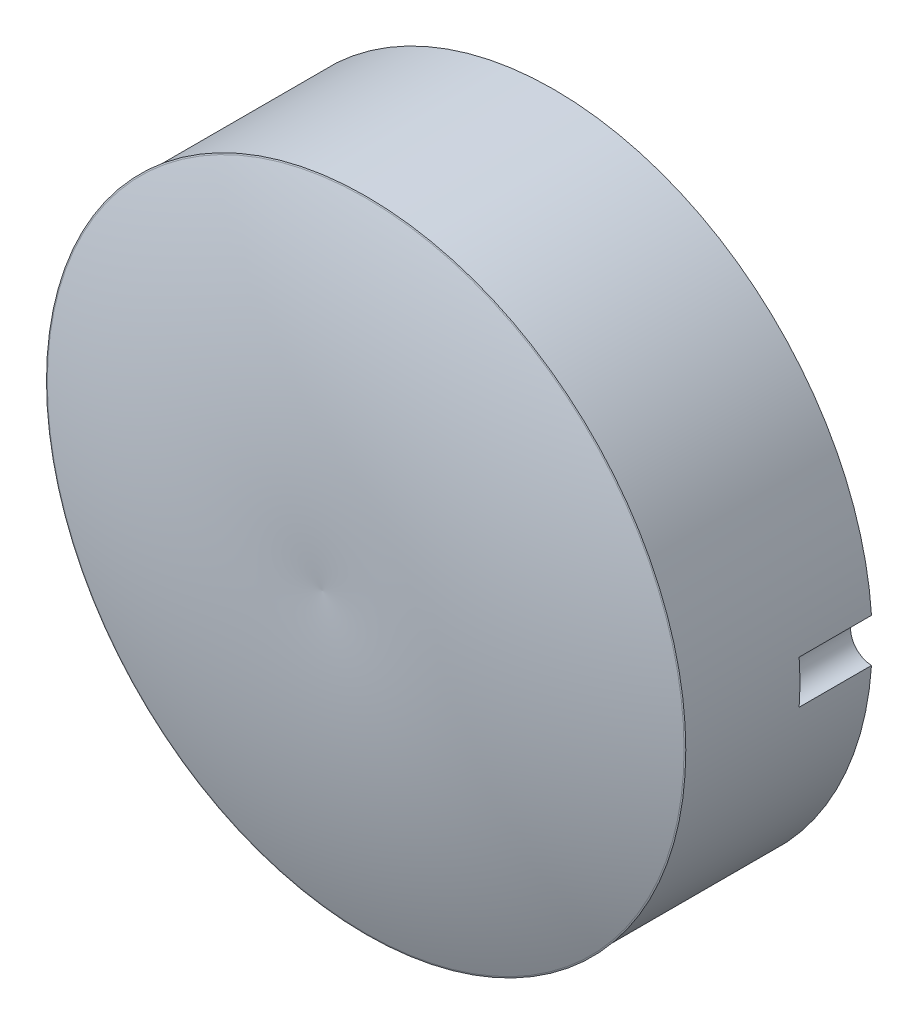
ISO-10303-21;
HEADER;
FILE_DESCRIPTION(('STEP AP214'),'2;1');
FILE_NAME('part.step','',(''),(''),'','','');
FILE_SCHEMA(('AUTOMOTIVE_DESIGN { 1 0 10303 214 1 1 1 1 }'));
ENDSEC;
DATA;
#1=APPLICATION_CONTEXT('core data for automotive mechanical design processes');
#2=APPLICATION_PROTOCOL_DEFINITION('international standard','automotive_design',2000,#1);
#3=PRODUCT_CONTEXT('',#1,'mechanical');
#4=PRODUCT('Part','Part','',(#3));
#5=PRODUCT_RELATED_PRODUCT_CATEGORY('part','',(#4));
#6=PRODUCT_DEFINITION_FORMATION('','',#4);
#7=PRODUCT_DEFINITION_CONTEXT('part definition',#1,'design');
#8=PRODUCT_DEFINITION('design','',#6,#7);
#9=PRODUCT_DEFINITION_SHAPE('','',#8);
#10=(LENGTH_UNIT() NAMED_UNIT(*) SI_UNIT(.MILLI.,.METRE.));
#11=(NAMED_UNIT(*) PLANE_ANGLE_UNIT() SI_UNIT($,.RADIAN.));
#12=(NAMED_UNIT(*) SI_UNIT($,.STERADIAN.) SOLID_ANGLE_UNIT());
#13=UNCERTAINTY_MEASURE_WITH_UNIT(LENGTH_MEASURE(1.E-05),#10,'distance_accuracy_value','');
#14=(GEOMETRIC_REPRESENTATION_CONTEXT(3) GLOBAL_UNCERTAINTY_ASSIGNED_CONTEXT((#13)) GLOBAL_UNIT_ASSIGNED_CONTEXT((#10,
#11,#12)) REPRESENTATION_CONTEXT('',''));
#15=CARTESIAN_POINT('',(0.,0.,0.));
#16=DIRECTION('',(0.,0.,1.));
#17=DIRECTION('',(1.,0.,0.));
#18=AXIS2_PLACEMENT_3D('',#15,#16,#17);
#19=CARTESIAN_POINT('',(0.,0.,13.));
#20=DIRECTION('',(0.,0.,-1.));
#21=DIRECTION('',(-1.,0.,0.));
#22=AXIS2_PLACEMENT_3D('',#19,#20,#21);
#23=CYLINDRICAL_SURFACE('',#22,22.);
#24=CARTESIAN_POINT('',(0.,0.,0.));
#25=DIRECTION('',(0.,0.,1.));
#26=DIRECTION('',(1.,0.,0.));
#27=AXIS2_PLACEMENT_3D('',#24,#25,#26);
#28=CIRCLE('',#27,22.);
#29=CARTESIAN_POINT('',(21.9488636363636,1.49912810403716,0.));
#30=VERTEX_POINT('',#29);
#31=CARTESIAN_POINT('',(21.9488636363636,-1.49912810403717,0.));
#32=VERTEX_POINT('',#31);
#33=EDGE_CURVE('E74',#30,#32,#28,.T.);
#34=ORIENTED_EDGE('',*,*,#33,.T.);
#35=DIRECTION('',(0.,0.,-1.));
#36=VECTOR('',#35,1.);
#37=CARTESIAN_POINT('',(21.9488636363636,-1.49912810403716,2.5));
#38=LINE('',#37,#36);
#39=CARTESIAN_POINT('',(21.9488636363636,-1.49912810403716,5.));
#40=VERTEX_POINT('',#39);
#41=EDGE_CURVE('E49',#32,#40,#38,.F.);
#42=ORIENTED_EDGE('',*,*,#41,.T.);
#43=CARTESIAN_POINT('',(0.,0.,5.));
#44=DIRECTION('',(0.,0.,-1.));
#45=DIRECTION('',(-1.,0.,0.));
#46=AXIS2_PLACEMENT_3D('',#43,#44,#45);
#47=CIRCLE('',#46,22.);
#48=CARTESIAN_POINT('',(21.9488636363636,1.49912810403716,5.));
#49=VERTEX_POINT('',#48);
#50=EDGE_CURVE('E11',#49,#40,#47,.T.);
#51=ORIENTED_EDGE('',*,*,#50,.F.);
#52=DIRECTION('',(0.,0.,-1.));
#53=VECTOR('',#52,1.);
#54=CARTESIAN_POINT('',(21.9488636363636,1.49912810403716,2.5));
#55=LINE('',#54,#53);
#56=EDGE_CURVE('E61',#49,#30,#55,.T.);
#57=ORIENTED_EDGE('',*,*,#56,.T.);
#58=EDGE_LOOP('',(#34,#42,#51,#57));
#59=FACE_BOUND('',#58,.T.);
#60=CARTESIAN_POINT('',(0.,0.,12.970111190264));
#61=DIRECTION('',(0.,0.,-1.));
#62=DIRECTION('',(-1.,0.,0.));
#63=AXIS2_PLACEMENT_3D('',#60,#61,#62);
#64=CIRCLE('',#63,22.);
#65=CARTESIAN_POINT('',(-22.,0.,12.970111190264));
#66=VERTEX_POINT('',#65);
#67=EDGE_CURVE('E84',#66,#66,#64,.F.);
#68=ORIENTED_EDGE('',*,*,#67,.F.);
#69=EDGE_LOOP('',(#68));
#70=FACE_BOUND('',#69,.T.);
#71=ADVANCED_FACE('F35',(#59,#70),#23,.T.);
#72=CARTESIAN_POINT('',(0.,0.,0.));
#73=DIRECTION('',(0.,0.,1.));
#74=DIRECTION('',(1.,0.,0.));
#75=AXIS2_PLACEMENT_3D('',#72,#73,#74);
#76=PLANE('',#75);
#77=ORIENTED_EDGE('',*,*,#33,.F.);
#78=CARTESIAN_POINT('',(22.,0.,0.));
#79=DIRECTION('',(0.,0.,1.));
#80=DIRECTION('',(1.,0.,0.));
#81=AXIS2_PLACEMENT_3D('',#78,#79,#80);
#82=CIRCLE('',#81,1.5);
#83=EDGE_CURVE('E42',#30,#32,#82,.T.);
#84=ORIENTED_EDGE('',*,*,#83,.T.);
#85=EDGE_LOOP('',(#77,#84));
#86=FACE_BOUND('',#85,.T.);
#87=ADVANCED_FACE('F87',(#86),#76,.F.);
#88=CARTESIAN_POINT('',(0.,0.,12.969993281672));
#89=DIRECTION('',(0.,0.,-1.));
#90=DIRECTION('',(-1.,0.,0.));
#91=AXIS2_PLACEMENT_3D('',#88,#89,#90);
#92=CONICAL_SURFACE('',#91,22.0867879666784,1.56943774537003);
#93=CARTESIAN_POINT('',(0.,0.,12.969993281672));
#94=DIRECTION('',(0.,0.,-1.));
#95=DIRECTION('',(-1.,0.,0.));
#96=AXIS2_PLACEMENT_3D('',#93,#94,#95);
#97=CIRCLE('',#96,22.0867879666784);
#98=CARTESIAN_POINT('',(-22.0867879666784,0.,12.969993281672));
#99=VERTEX_POINT('',#98);
#100=EDGE_CURVE('E75',#99,#99,#97,.T.);
#101=ORIENTED_EDGE('',*,*,#100,.T.);
#102=EDGE_LOOP('',(#101));
#103=FACE_BOUND('',#102,.T.);
#104=ORIENTED_EDGE('',*,*,#67,.T.);
#105=EDGE_LOOP('',(#104));
#106=FACE_BOUND('',#105,.T.);
#107=ADVANCED_FACE('F89',(#103,#106),#92,.F.);
#108=CARTESIAN_POINT('',(-4.14319570812685,0.,-35.7832314737364));
#109=DIRECTION('',(0.,-1.,0.));
#110=DIRECTION('',(-1.,0.,0.));
#111=AXIS2_PLACEMENT_3D('',#108,#109,#110);
#112=CIRCLE('',#111,51.9487163704591);
#113=TRIMMED_CURVE('',#112,(PARAMETER_VALUE(-1.65063662035426)),
(PARAMETER_VALUE(1.65063662035426)),.T.,.PARAMETER.);
#114=CARTESIAN_POINT('',(0.,0.,-35.7832314737364));
#115=DIRECTION('',(0.,0.,-1.));
#116=AXIS1_PLACEMENT('',#114,#115);
#117=SURFACE_OF_REVOLUTION('',#113,#116);
#118=CARTESIAN_POINT('',(0.,0.,16.));
#119=VERTEX_POINT('',#118);
#120=VERTEX_LOOP('',#119);
#121=FACE_BOUND('',#120,.T.);
#122=CARTESIAN_POINT('',(0.,0.,13.));
#123=DIRECTION('',(0.,0.,-1.));
#124=DIRECTION('',(-1.,0.,0.));
#125=AXIS2_PLACEMENT_3D('',#122,#123,#124);
#126=CIRCLE('',#125,22.);
#127=CARTESIAN_POINT('',(-22.,0.,13.));
#128=VERTEX_POINT('',#127);
#129=EDGE_CURVE('E78',#128,#128,#126,.T.);
#130=ORIENTED_EDGE('',*,*,#129,.F.);
#131=EDGE_LOOP('',(#130));
#132=FACE_BOUND('',#131,.T.);
#133=ADVANCED_FACE('F95',(#121,#132),#117,.T.);
#134=CARTESIAN_POINT('',(0.,0.,13.));
#135=DIRECTION('',(0.,0.,-1.));
#136=DIRECTION('',(-1.,0.,0.));
#137=AXIS2_PLACEMENT_3D('',#134,#135,#136);
#138=CONICAL_SURFACE('',#137,22.,1.23791498086308);
#139=ORIENTED_EDGE('',*,*,#100,.F.);
#140=EDGE_LOOP('',(#139));
#141=FACE_BOUND('',#140,.T.);
#142=ORIENTED_EDGE('',*,*,#129,.T.);
#143=EDGE_LOOP('',(#142));
#144=FACE_BOUND('',#143,.T.);
#145=ADVANCED_FACE('F101',(#141,#144),#138,.T.);
#146=CARTESIAN_POINT('',(22.,0.,5.));
#147=DIRECTION('',(0.,0.,-1.));
#148=DIRECTION('',(-1.,0.,0.));
#149=AXIS2_PLACEMENT_3D('',#146,#147,#148);
#150=PLANE('',#149);
#151=ORIENTED_EDGE('',*,*,#50,.T.);
#152=CARTESIAN_POINT('',(22.,0.,5.));
#153=DIRECTION('',(0.,0.,-1.));
#154=DIRECTION('',(-1.,0.,0.));
#155=AXIS2_PLACEMENT_3D('',#152,#153,#154);
#156=CIRCLE('',#155,1.5);
#157=EDGE_CURVE('E64',#40,#49,#156,.T.);
#158=ORIENTED_EDGE('',*,*,#157,.T.);
#159=EDGE_LOOP('',(#151,#158));
#160=FACE_BOUND('',#159,.T.);
#161=ADVANCED_FACE('F71',(#160),#150,.T.);
#162=CARTESIAN_POINT('',(22.,0.,5.));
#163=DIRECTION('',(0.,0.,-1.));
#164=DIRECTION('',(-1.,0.,0.));
#165=AXIS2_PLACEMENT_3D('',#162,#163,#164);
#166=CYLINDRICAL_SURFACE('',#165,1.5);
#167=ORIENTED_EDGE('',*,*,#83,.F.);
#168=ORIENTED_EDGE('',*,*,#56,.F.);
#169=ORIENTED_EDGE('',*,*,#157,.F.);
#170=ORIENTED_EDGE('',*,*,#41,.F.);
#171=EDGE_LOOP('',(#167,#168,#169,#170));
#172=FACE_BOUND('',#171,.T.);
#173=ADVANCED_FACE('F63',(#172),#166,.F.);
#174=CLOSED_SHELL('',(#71,#87,#107,#133,#145,#161,#173));
#175=MANIFOLD_SOLID_BREP('B2',#174);
#176=ADVANCED_BREP_SHAPE_REPRESENTATION('',(#18,#175),#14);
#177=SHAPE_DEFINITION_REPRESENTATION(#9,#176);
ENDSEC;
END-ISO-10303-21;
